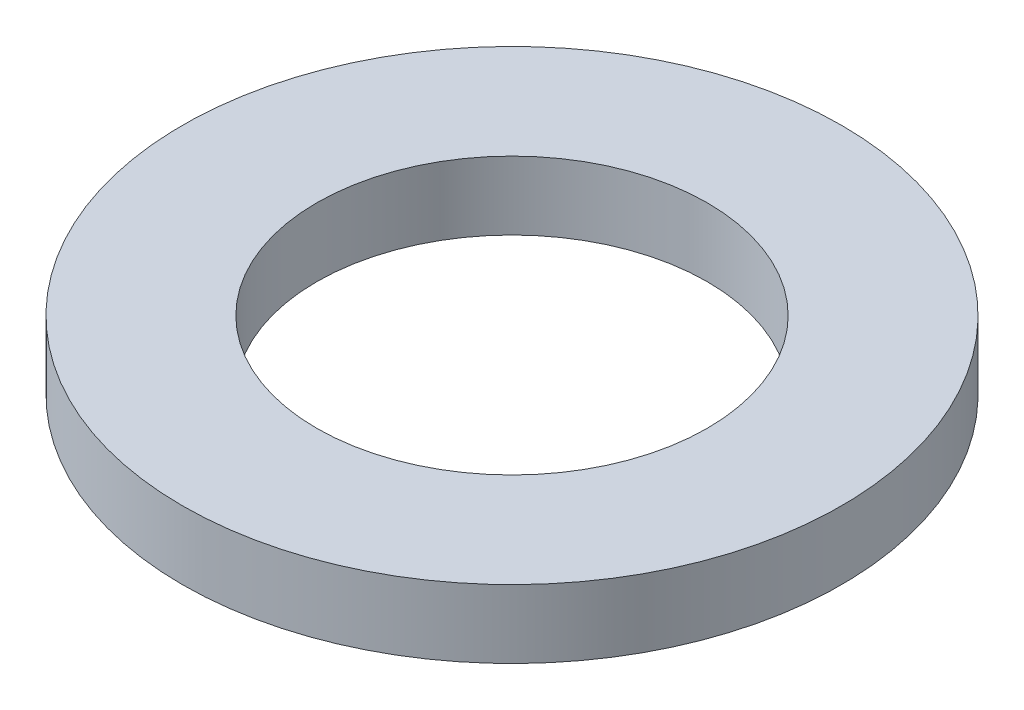
ISO-10303-21;
HEADER;
FILE_DESCRIPTION(('STEP AP214'),'2;1');
FILE_NAME('part.step','',(''),(''),'','','');
FILE_SCHEMA(('AUTOMOTIVE_DESIGN { 1 0 10303 214 1 1 1 1 }'));
ENDSEC;
DATA;
#1=APPLICATION_CONTEXT('core data for automotive mechanical design processes');
#2=APPLICATION_PROTOCOL_DEFINITION('international standard','automotive_design',2000,#1);
#3=PRODUCT_CONTEXT('',#1,'mechanical');
#4=PRODUCT('Part','Part','',(#3));
#5=PRODUCT_RELATED_PRODUCT_CATEGORY('part','',(#4));
#6=PRODUCT_DEFINITION_FORMATION('','',#4);
#7=PRODUCT_DEFINITION_CONTEXT('part definition',#1,'design');
#8=PRODUCT_DEFINITION('design','',#6,#7);
#9=PRODUCT_DEFINITION_SHAPE('','',#8);
#10=(LENGTH_UNIT() NAMED_UNIT(*) SI_UNIT(.MILLI.,.METRE.));
#11=(NAMED_UNIT(*) PLANE_ANGLE_UNIT() SI_UNIT($,.RADIAN.));
#12=(NAMED_UNIT(*) SI_UNIT($,.STERADIAN.) SOLID_ANGLE_UNIT());
#13=UNCERTAINTY_MEASURE_WITH_UNIT(LENGTH_MEASURE(1.E-05),#10,'distance_accuracy_value','');
#14=(GEOMETRIC_REPRESENTATION_CONTEXT(3) GLOBAL_UNCERTAINTY_ASSIGNED_CONTEXT((#13)) GLOBAL_UNIT_ASSIGNED_CONTEXT((#10,
#11,#12)) REPRESENTATION_CONTEXT('',''));
#15=CARTESIAN_POINT('',(0.,0.,0.));
#16=DIRECTION('',(0.,0.,1.));
#17=DIRECTION('',(1.,0.,0.));
#18=AXIS2_PLACEMENT_3D('',#15,#16,#17);
#19=CARTESIAN_POINT('',(0.,14.,0.));
#20=DIRECTION('',(0.,-1.,0.));
#21=DIRECTION('',(0.,0.,-1.));
#22=AXIS2_PLACEMENT_3D('',#19,#20,#21);
#23=CYLINDRICAL_SURFACE('',#22,67.5);
#24=CARTESIAN_POINT('',(0.,14.,0.));
#25=DIRECTION('',(0.,1.,0.));
#26=DIRECTION('',(0.,0.,1.));
#27=AXIS2_PLACEMENT_3D('',#24,#25,#26);
#28=CIRCLE('',#27,67.5);
#29=CARTESIAN_POINT('',(0.,14.,67.5));
#30=VERTEX_POINT('',#29);
#31=EDGE_CURVE('E10',#30,#30,#28,.T.);
#32=ORIENTED_EDGE('',*,*,#31,.F.);
#33=EDGE_LOOP('',(#32));
#34=FACE_BOUND('',#33,.T.);
#35=CARTESIAN_POINT('',(0.,0.,0.));
#36=DIRECTION('',(0.,1.,0.));
#37=DIRECTION('',(0.,0.,1.));
#38=AXIS2_PLACEMENT_3D('',#35,#36,#37);
#39=CIRCLE('',#38,67.5);
#40=CARTESIAN_POINT('',(0.,0.,67.5));
#41=VERTEX_POINT('',#40);
#42=EDGE_CURVE('E37',#41,#41,#39,.T.);
#43=ORIENTED_EDGE('',*,*,#42,.T.);
#44=EDGE_LOOP('',(#43));
#45=FACE_BOUND('',#44,.T.);
#46=ADVANCED_FACE('F40',(#34,#45),#23,.T.);
#47=CARTESIAN_POINT('',(0.,14.,0.));
#48=DIRECTION('',(0.,1.,0.));
#49=DIRECTION('',(0.,0.,1.));
#50=AXIS2_PLACEMENT_3D('',#47,#48,#49);
#51=PLANE('',#50);
#52=CARTESIAN_POINT('',(0.,14.,0.));
#53=DIRECTION('',(0.,1.,0.));
#54=DIRECTION('',(0.,0.,1.));
#55=AXIS2_PLACEMENT_3D('',#52,#53,#54);
#56=CIRCLE('',#55,40.);
#57=CARTESIAN_POINT('',(0.,14.,40.));
#58=VERTEX_POINT('',#57);
#59=EDGE_CURVE('E50',#58,#58,#56,.T.);
#60=ORIENTED_EDGE('',*,*,#59,.F.);
#61=EDGE_LOOP('',(#60));
#62=FACE_BOUND('',#61,.T.);
#63=ORIENTED_EDGE('',*,*,#31,.T.);
#64=EDGE_LOOP('',(#63));
#65=FACE_BOUND('',#64,.T.);
#66=ADVANCED_FACE('F59',(#62,#65),#51,.T.);
#67=CARTESIAN_POINT('',(0.,0.,0.));
#68=DIRECTION('',(0.,1.,0.));
#69=DIRECTION('',(0.,0.,1.));
#70=AXIS2_PLACEMENT_3D('',#67,#68,#69);
#71=PLANE('',#70);
#72=CARTESIAN_POINT('',(0.,0.,0.));
#73=DIRECTION('',(0.,1.,0.));
#74=DIRECTION('',(0.,0.,1.));
#75=AXIS2_PLACEMENT_3D('',#72,#73,#74);
#76=CIRCLE('',#75,40.);
#77=CARTESIAN_POINT('',(0.,0.,40.));
#78=VERTEX_POINT('',#77);
#79=EDGE_CURVE('E47',#78,#78,#76,.T.);
#80=ORIENTED_EDGE('',*,*,#79,.T.);
#81=EDGE_LOOP('',(#80));
#82=FACE_BOUND('',#81,.T.);
#83=ORIENTED_EDGE('',*,*,#42,.F.);
#84=EDGE_LOOP('',(#83));
#85=FACE_BOUND('',#84,.T.);
#86=ADVANCED_FACE('F58',(#82,#85),#71,.F.);
#87=CARTESIAN_POINT('',(0.,14.,0.));
#88=DIRECTION('',(0.,-1.,0.));
#89=DIRECTION('',(0.,0.,-1.));
#90=AXIS2_PLACEMENT_3D('',#87,#88,#89);
#91=CYLINDRICAL_SURFACE('',#90,40.);
#92=ORIENTED_EDGE('',*,*,#59,.T.);
#93=EDGE_LOOP('',(#92));
#94=FACE_BOUND('',#93,.T.);
#95=ORIENTED_EDGE('',*,*,#79,.F.);
#96=EDGE_LOOP('',(#95));
#97=FACE_BOUND('',#96,.T.);
#98=ADVANCED_FACE('F54',(#94,#97),#91,.F.);
#99=CLOSED_SHELL('',(#46,#66,#86,#98));
#100=MANIFOLD_SOLID_BREP('B2',#99);
#101=ADVANCED_BREP_SHAPE_REPRESENTATION('',(#18,#100),#14);
#102=SHAPE_DEFINITION_REPRESENTATION(#9,#101);
ENDSEC;
END-ISO-10303-21;
